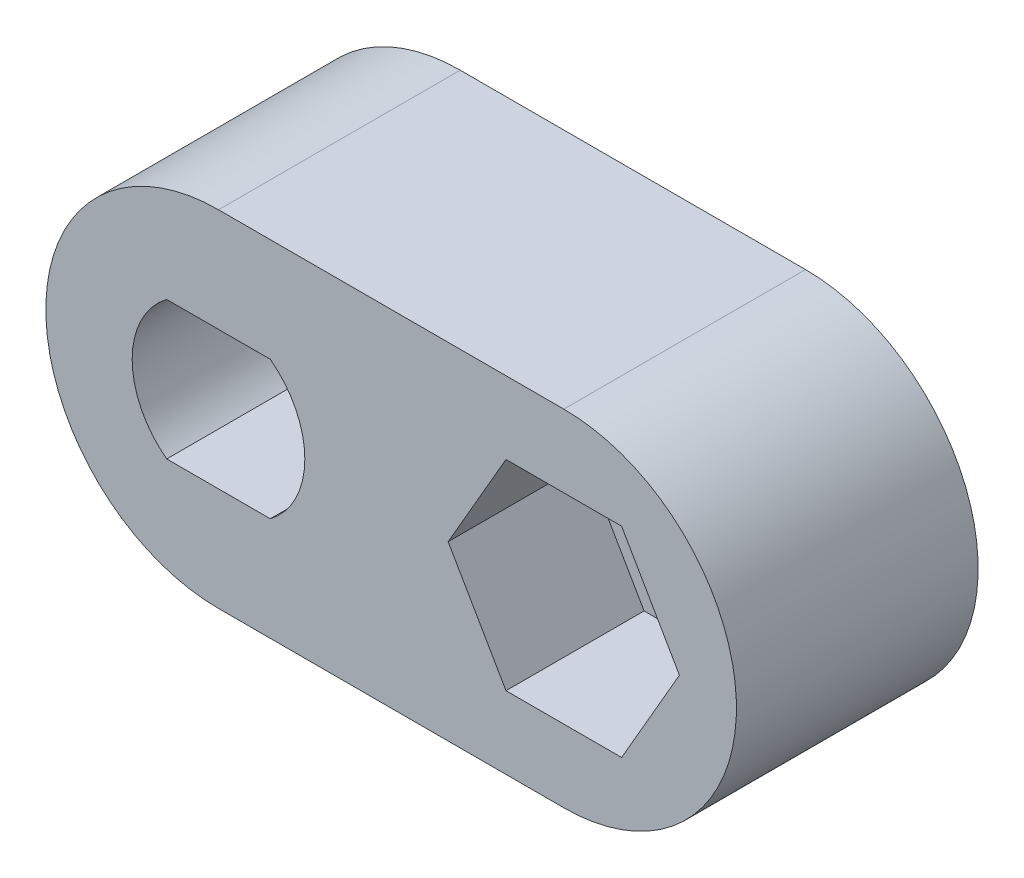
ISO-10303-21;
HEADER;
FILE_DESCRIPTION(('STEP AP214'),'2;1');
FILE_NAME('part.step','',(''),(''),'','','');
FILE_SCHEMA(('AUTOMOTIVE_DESIGN { 1 0 10303 214 1 1 1 1 }'));
ENDSEC;
DATA;
#1=APPLICATION_CONTEXT('core data for automotive mechanical design processes');
#2=APPLICATION_PROTOCOL_DEFINITION('international standard','automotive_design',2000,#1);
#3=PRODUCT_CONTEXT('',#1,'mechanical');
#4=PRODUCT('Part','Part','',(#3));
#5=PRODUCT_RELATED_PRODUCT_CATEGORY('part','',(#4));
#6=PRODUCT_DEFINITION_FORMATION('','',#4);
#7=PRODUCT_DEFINITION_CONTEXT('part definition',#1,'design');
#8=PRODUCT_DEFINITION('design','',#6,#7);
#9=PRODUCT_DEFINITION_SHAPE('','',#8);
#10=(LENGTH_UNIT() NAMED_UNIT(*) SI_UNIT(.MILLI.,.METRE.));
#11=(NAMED_UNIT(*) PLANE_ANGLE_UNIT() SI_UNIT($,.RADIAN.));
#12=(NAMED_UNIT(*) SI_UNIT($,.STERADIAN.) SOLID_ANGLE_UNIT());
#13=UNCERTAINTY_MEASURE_WITH_UNIT(LENGTH_MEASURE(1.E-05),#10,'distance_accuracy_value','');
#14=(GEOMETRIC_REPRESENTATION_CONTEXT(3) GLOBAL_UNCERTAINTY_ASSIGNED_CONTEXT((#13)) GLOBAL_UNIT_ASSIGNED_CONTEXT((#10,
#11,#12)) REPRESENTATION_CONTEXT('',''));
#15=CARTESIAN_POINT('',(0.,0.,0.));
#16=DIRECTION('',(0.,0.,1.));
#17=DIRECTION('',(1.,0.,0.));
#18=AXIS2_PLACEMENT_3D('',#15,#16,#17);
#19=CARTESIAN_POINT('',(10.,0.,0.));
#20=DIRECTION('',(0.,0.,-1.));
#21=DIRECTION('',(-1.,0.,0.));
#22=AXIS2_PLACEMENT_3D('',#19,#20,#21);
#23=CYLINDRICAL_SURFACE('',#22,2.07500000000001);
#24=CARTESIAN_POINT('',(10.,0.,0.));
#25=DIRECTION('',(0.,0.,-1.));
#26=DIRECTION('',(-1.,0.,0.));
#27=AXIS2_PLACEMENT_3D('',#24,#25,#26);
#28=CIRCLE('',#27,2.07500000000001);
#29=CARTESIAN_POINT('',(7.92499999999999,0.,0.));
#30=VERTEX_POINT('',#29);
#31=EDGE_CURVE('E207',#30,#30,#28,.T.);
#32=ORIENTED_EDGE('',*,*,#31,.T.);
#33=EDGE_LOOP('',(#32));
#34=FACE_BOUND('',#33,.T.);
#35=CARTESIAN_POINT('',(10.,0.,3.));
#36=DIRECTION('',(0.,0.,1.));
#37=DIRECTION('',(1.,0.,0.));
#38=AXIS2_PLACEMENT_3D('',#35,#36,#37);
#39=CIRCLE('',#38,2.07500000000001);
#40=CARTESIAN_POINT('',(12.075,0.,3.));
#41=VERTEX_POINT('',#40);
#42=EDGE_CURVE('E52',#41,#41,#39,.F.);
#43=ORIENTED_EDGE('',*,*,#42,.F.);
#44=EDGE_LOOP('',(#43));
#45=FACE_BOUND('',#44,.T.);
#46=ADVANCED_FACE('F48',(#34,#45),#23,.F.);
#47=CARTESIAN_POINT('',(0.,0.,7.));
#48=DIRECTION('',(0.,0.,-1.));
#49=DIRECTION('',(-1.,0.,0.));
#50=AXIS2_PLACEMENT_3D('',#47,#48,#49);
#51=CYLINDRICAL_SURFACE('',#50,5.);
#52=CARTESIAN_POINT('',(0.,0.,0.));
#53=DIRECTION('',(0.,0.,1.));
#54=DIRECTION('',(1.,0.,0.));
#55=AXIS2_PLACEMENT_3D('',#52,#53,#54);
#56=CIRCLE('',#55,5.);
#57=CARTESIAN_POINT('',(0.,5.,0.));
#58=VERTEX_POINT('',#57);
#59=CARTESIAN_POINT('',(0.,-5.,0.));
#60=VERTEX_POINT('',#59);
#61=EDGE_CURVE('E237',#58,#60,#56,.T.);
#62=ORIENTED_EDGE('',*,*,#61,.T.);
#63=DIRECTION('',(0.,0.,-1.));
#64=VECTOR('',#63,1.);
#65=CARTESIAN_POINT('',(0.,-5.,7.));
#66=LINE('',#65,#64);
#67=CARTESIAN_POINT('',(0.,-5.,7.));
#68=VERTEX_POINT('',#67);
#69=EDGE_CURVE('E13',#68,#60,#66,.T.);
#70=ORIENTED_EDGE('',*,*,#69,.F.);
#71=CARTESIAN_POINT('',(0.,0.,7.));
#72=DIRECTION('',(0.,0.,1.));
#73=DIRECTION('',(1.,0.,0.));
#74=AXIS2_PLACEMENT_3D('',#71,#72,#73);
#75=CIRCLE('',#74,5.);
#76=CARTESIAN_POINT('',(0.,5.,7.));
#77=VERTEX_POINT('',#76);
#78=EDGE_CURVE('E243',#77,#68,#75,.T.);
#79=ORIENTED_EDGE('',*,*,#78,.F.);
#80=DIRECTION('',(0.,0.,-1.));
#81=VECTOR('',#80,1.);
#82=CARTESIAN_POINT('',(0.,5.,7.));
#83=LINE('',#82,#81);
#84=EDGE_CURVE('E253',#77,#58,#83,.T.);
#85=ORIENTED_EDGE('',*,*,#84,.T.);
#86=EDGE_LOOP('',(#62,#70,#79,#85));
#87=FACE_BOUND('',#86,.T.);
#88=ADVANCED_FACE('F50',(#87),#51,.T.);
#89=CARTESIAN_POINT('',(0.,-5.,7.));
#90=DIRECTION('',(0.,1.,0.));
#91=DIRECTION('',(0.,0.,1.));
#92=AXIS2_PLACEMENT_3D('',#89,#90,#91);
#93=PLANE('',#92);
#94=DIRECTION('',(1.,0.,0.));
#95=VECTOR('',#94,1.);
#96=CARTESIAN_POINT('',(0.,-5.,0.));
#97=LINE('',#96,#95);
#98=CARTESIAN_POINT('',(10.,-5.,0.));
#99=VERTEX_POINT('',#98);
#100=EDGE_CURVE('E256',#60,#99,#97,.T.);
#101=ORIENTED_EDGE('',*,*,#100,.T.);
#102=DIRECTION('',(0.,0.,-1.));
#103=VECTOR('',#102,1.);
#104=CARTESIAN_POINT('',(10.,-5.,7.));
#105=LINE('',#104,#103);
#106=CARTESIAN_POINT('',(10.,-5.,7.));
#107=VERTEX_POINT('',#106);
#108=EDGE_CURVE('E57',#107,#99,#105,.T.);
#109=ORIENTED_EDGE('',*,*,#108,.F.);
#110=DIRECTION('',(1.,0.,0.));
#111=VECTOR('',#110,1.);
#112=CARTESIAN_POINT('',(0.,-5.,7.));
#113=LINE('',#112,#111);
#114=EDGE_CURVE('E246',#68,#107,#113,.T.);
#115=ORIENTED_EDGE('',*,*,#114,.F.);
#116=ORIENTED_EDGE('',*,*,#69,.T.);
#117=EDGE_LOOP('',(#101,#109,#115,#116));
#118=FACE_BOUND('',#117,.T.);
#119=ADVANCED_FACE('F312',(#118),#93,.F.);
#120=CARTESIAN_POINT('',(10.,0.,7.));
#121=DIRECTION('',(0.,0.,-1.));
#122=DIRECTION('',(-1.,0.,0.));
#123=AXIS2_PLACEMENT_3D('',#120,#121,#122);
#124=CYLINDRICAL_SURFACE('',#123,5.);
#125=CARTESIAN_POINT('',(10.,0.,0.));
#126=DIRECTION('',(0.,0.,1.));
#127=DIRECTION('',(1.,0.,0.));
#128=AXIS2_PLACEMENT_3D('',#125,#126,#127);
#129=CIRCLE('',#128,5.);
#130=CARTESIAN_POINT('',(10.,5.,0.));
#131=VERTEX_POINT('',#130);
#132=EDGE_CURVE('E258',#99,#131,#129,.T.);
#133=ORIENTED_EDGE('',*,*,#132,.T.);
#134=DIRECTION('',(0.,0.,-1.));
#135=VECTOR('',#134,1.);
#136=CARTESIAN_POINT('',(10.,5.,7.));
#137=LINE('',#136,#135);
#138=CARTESIAN_POINT('',(10.,5.,7.));
#139=VERTEX_POINT('',#138);
#140=EDGE_CURVE('E263',#139,#131,#137,.T.);
#141=ORIENTED_EDGE('',*,*,#140,.F.);
#142=CARTESIAN_POINT('',(10.,0.,7.));
#143=DIRECTION('',(0.,0.,1.));
#144=DIRECTION('',(1.,0.,0.));
#145=AXIS2_PLACEMENT_3D('',#142,#143,#144);
#146=CIRCLE('',#145,5.);
#147=EDGE_CURVE('E249',#107,#139,#146,.T.);
#148=ORIENTED_EDGE('',*,*,#147,.F.);
#149=ORIENTED_EDGE('',*,*,#108,.T.);
#150=EDGE_LOOP('',(#133,#141,#148,#149));
#151=FACE_BOUND('',#150,.T.);
#152=ADVANCED_FACE('F415',(#151),#124,.T.);
#153=CARTESIAN_POINT('',(0.,5.,7.));
#154=DIRECTION('',(0.,-1.,0.));
#155=DIRECTION('',(0.,0.,-1.));
#156=AXIS2_PLACEMENT_3D('',#153,#154,#155);
#157=PLANE('',#156);
#158=DIRECTION('',(-1.,0.,0.));
#159=VECTOR('',#158,1.);
#160=CARTESIAN_POINT('',(0.,5.,0.));
#161=LINE('',#160,#159);
#162=EDGE_CURVE('E247',#131,#58,#161,.T.);
#163=ORIENTED_EDGE('',*,*,#162,.T.);
#164=ORIENTED_EDGE('',*,*,#84,.F.);
#165=DIRECTION('',(-1.,0.,0.));
#166=VECTOR('',#165,1.);
#167=CARTESIAN_POINT('',(0.,5.,7.));
#168=LINE('',#167,#166);
#169=EDGE_CURVE('E251',#139,#77,#168,.T.);
#170=ORIENTED_EDGE('',*,*,#169,.F.);
#171=ORIENTED_EDGE('',*,*,#140,.T.);
#172=EDGE_LOOP('',(#163,#164,#170,#171));
#173=FACE_BOUND('',#172,.T.);
#174=ADVANCED_FACE('F407',(#173),#157,.F.);
#175=CARTESIAN_POINT('',(0.,0.,7.));
#176=DIRECTION('',(0.,0.,1.));
#177=DIRECTION('',(1.,0.,0.));
#178=AXIS2_PLACEMENT_3D('',#175,#176,#177);
#179=PLANE('',#178);
#180=DIRECTION('',(0.5,-0.866025403784439,0.));
#181=VECTOR('',#180,1.);
#182=CARTESIAN_POINT('',(6.65136843870017,0.,7.));
#183=LINE('',#182,#181);
#184=CARTESIAN_POINT('',(6.65136843870017,0.,7.));
#185=VERTEX_POINT('',#184);
#186=CARTESIAN_POINT('',(8.32568421935009,-2.9,7.));
#187=VERTEX_POINT('',#186);
#188=EDGE_CURVE('E65',#185,#187,#183,.T.);
#189=ORIENTED_EDGE('',*,*,#188,.F.);
#190=DIRECTION('',(-0.5,-0.866025403784438,0.));
#191=VECTOR('',#190,1.);
#192=CARTESIAN_POINT('',(8.32568421935009,2.9,7.));
#193=LINE('',#192,#191);
#194=CARTESIAN_POINT('',(8.32568421935009,2.9,7.));
#195=VERTEX_POINT('',#194);
#196=EDGE_CURVE('E174',#195,#185,#193,.T.);
#197=ORIENTED_EDGE('',*,*,#196,.F.);
#198=DIRECTION('',(-1.,0.,0.));
#199=VECTOR('',#198,1.);
#200=CARTESIAN_POINT('',(11.6743157806499,2.9,7.));
#201=LINE('',#200,#199);
#202=CARTESIAN_POINT('',(11.6743157806499,2.9,7.));
#203=VERTEX_POINT('',#202);
#204=EDGE_CURVE('E177',#203,#195,#201,.T.);
#205=ORIENTED_EDGE('',*,*,#204,.F.);
#206=DIRECTION('',(-0.5,0.866025403784439,0.));
#207=VECTOR('',#206,1.);
#208=CARTESIAN_POINT('',(13.3486315612998,0.,7.));
#209=LINE('',#208,#207);
#210=CARTESIAN_POINT('',(13.3486315612998,0.,7.));
#211=VERTEX_POINT('',#210);
#212=EDGE_CURVE('E193',#211,#203,#209,.T.);
#213=ORIENTED_EDGE('',*,*,#212,.F.);
#214=DIRECTION('',(0.5,0.866025403784438,0.));
#215=VECTOR('',#214,1.);
#216=CARTESIAN_POINT('',(11.6743157806499,-2.9,7.));
#217=LINE('',#216,#215);
#218=CARTESIAN_POINT('',(11.6743157806499,-2.9,7.));
#219=VERTEX_POINT('',#218);
#220=EDGE_CURVE('E190',#219,#211,#217,.T.);
#221=ORIENTED_EDGE('',*,*,#220,.F.);
#222=DIRECTION('',(1.,0.,0.));
#223=VECTOR('',#222,1.);
#224=CARTESIAN_POINT('',(8.32568421935009,-2.9,7.));
#225=LINE('',#224,#223);
#226=EDGE_CURVE('E188',#187,#219,#225,.T.);
#227=ORIENTED_EDGE('',*,*,#226,.F.);
#228=EDGE_LOOP('',(#189,#197,#205,#213,#221,#227));
#229=FACE_BOUND('',#228,.T.);
#230=CARTESIAN_POINT('',(0.,0.,7.));
#231=DIRECTION('',(0.,0.,1.));
#232=DIRECTION('',(1.,0.,0.));
#233=AXIS2_PLACEMENT_3D('',#230,#231,#232);
#234=CIRCLE('',#233,2.5);
#235=CARTESIAN_POINT('',(1.5,-2.,7.));
#236=VERTEX_POINT('',#235);
#237=CARTESIAN_POINT('',(1.5,2.,7.));
#238=VERTEX_POINT('',#237);
#239=EDGE_CURVE('E73',#236,#238,#234,.T.);
#240=ORIENTED_EDGE('',*,*,#239,.F.);
#241=DIRECTION('',(1.,0.,0.));
#242=VECTOR('',#241,1.);
#243=CARTESIAN_POINT('',(0.,-2.,7.));
#244=LINE('',#243,#242);
#245=CARTESIAN_POINT('',(-1.5,-2.,7.));
#246=VERTEX_POINT('',#245);
#247=EDGE_CURVE('E221',#246,#236,#244,.T.);
#248=ORIENTED_EDGE('',*,*,#247,.F.);
#249=CARTESIAN_POINT('',(-1.5,2.,7.));
#250=VERTEX_POINT('',#249);
#251=EDGE_CURVE('E230',#250,#246,#234,.T.);
#252=ORIENTED_EDGE('',*,*,#251,.F.);
#253=DIRECTION('',(1.,0.,0.));
#254=VECTOR('',#253,1.);
#255=CARTESIAN_POINT('',(0.,2.,7.));
#256=LINE('',#255,#254);
#257=EDGE_CURVE('E229',#250,#238,#256,.T.);
#258=ORIENTED_EDGE('',*,*,#257,.T.);
#259=EDGE_LOOP('',(#240,#248,#252,#258));
#260=FACE_BOUND('',#259,.T.);
#261=ORIENTED_EDGE('',*,*,#78,.T.);
#262=ORIENTED_EDGE('',*,*,#114,.T.);
#263=ORIENTED_EDGE('',*,*,#147,.T.);
#264=ORIENTED_EDGE('',*,*,#169,.T.);
#265=EDGE_LOOP('',(#261,#262,#263,#264));
#266=FACE_BOUND('',#265,.T.);
#267=ADVANCED_FACE('F288',(#229,#260,#266),#179,.T.);
#268=CARTESIAN_POINT('',(0.,0.,0.));
#269=DIRECTION('',(0.,0.,1.));
#270=DIRECTION('',(1.,0.,0.));
#271=AXIS2_PLACEMENT_3D('',#268,#269,#270);
#272=PLANE('',#271);
#273=ORIENTED_EDGE('',*,*,#31,.F.);
#274=EDGE_LOOP('',(#273));
#275=FACE_BOUND('',#274,.T.);
#276=CARTESIAN_POINT('',(0.,0.,0.));
#277=DIRECTION('',(0.,0.,-1.));
#278=DIRECTION('',(-1.,0.,0.));
#279=AXIS2_PLACEMENT_3D('',#276,#277,#278);
#280=CIRCLE('',#279,3.36);
#281=CARTESIAN_POINT('',(-3.36,0.,0.));
#282=VERTEX_POINT('',#281);
#283=EDGE_CURVE('E210',#282,#282,#280,.T.);
#284=ORIENTED_EDGE('',*,*,#283,.F.);
#285=EDGE_LOOP('',(#284));
#286=FACE_BOUND('',#285,.T.);
#287=ORIENTED_EDGE('',*,*,#61,.F.);
#288=ORIENTED_EDGE('',*,*,#162,.F.);
#289=ORIENTED_EDGE('',*,*,#132,.F.);
#290=ORIENTED_EDGE('',*,*,#100,.F.);
#291=EDGE_LOOP('',(#287,#288,#289,#290));
#292=FACE_BOUND('',#291,.T.);
#293=ADVANCED_FACE('F303',(#275,#286,#292),#272,.F.);
#294=CARTESIAN_POINT('',(0.,0.,3.));
#295=DIRECTION('',(0.,0.,1.));
#296=DIRECTION('',(1.,0.,0.));
#297=AXIS2_PLACEMENT_3D('',#294,#295,#296);
#298=CYLINDRICAL_SURFACE('',#297,2.5);
#299=ORIENTED_EDGE('',*,*,#239,.T.);
#300=DIRECTION('',(0.,0.,1.));
#301=VECTOR('',#300,1.);
#302=CARTESIAN_POINT('',(1.5,2.,3.));
#303=LINE('',#302,#301);
#304=CARTESIAN_POINT('',(1.5,2.,3.));
#305=VERTEX_POINT('',#304);
#306=EDGE_CURVE('E227',#305,#238,#303,.T.);
#307=ORIENTED_EDGE('',*,*,#306,.F.);
#308=CARTESIAN_POINT('',(0.,0.,3.));
#309=DIRECTION('',(0.,0.,1.));
#310=DIRECTION('',(1.,0.,0.));
#311=AXIS2_PLACEMENT_3D('',#308,#309,#310);
#312=CIRCLE('',#311,2.5);
#313=CARTESIAN_POINT('',(1.5,-2.,3.));
#314=VERTEX_POINT('',#313);
#315=EDGE_CURVE('E217',#314,#305,#312,.T.);
#316=ORIENTED_EDGE('',*,*,#315,.F.);
#317=DIRECTION('',(0.,0.,1.));
#318=VECTOR('',#317,1.);
#319=CARTESIAN_POINT('',(1.5,-2.,3.));
#320=LINE('',#319,#318);
#321=EDGE_CURVE('E235',#314,#236,#320,.T.);
#322=ORIENTED_EDGE('',*,*,#321,.T.);
#323=EDGE_LOOP('',(#299,#307,#316,#322));
#324=FACE_BOUND('',#323,.T.);
#325=ADVANCED_FACE('F283',(#324),#298,.F.);
#326=CARTESIAN_POINT('',(0.,-2.,3.));
#327=DIRECTION('',(0.,-1.,0.));
#328=DIRECTION('',(0.,0.,-1.));
#329=AXIS2_PLACEMENT_3D('',#326,#327,#328);
#330=PLANE('',#329);
#331=ORIENTED_EDGE('',*,*,#247,.T.);
#332=ORIENTED_EDGE('',*,*,#321,.F.);
#333=DIRECTION('',(1.,0.,0.));
#334=VECTOR('',#333,1.);
#335=CARTESIAN_POINT('',(0.,-2.,3.));
#336=LINE('',#335,#334);
#337=CARTESIAN_POINT('',(-1.5,-2.,3.));
#338=VERTEX_POINT('',#337);
#339=EDGE_CURVE('E224',#338,#314,#336,.T.);
#340=ORIENTED_EDGE('',*,*,#339,.F.);
#341=DIRECTION('',(0.,0.,1.));
#342=VECTOR('',#341,1.);
#343=CARTESIAN_POINT('',(-1.5,-2.,3.));
#344=LINE('',#343,#342);
#345=EDGE_CURVE('E238',#338,#246,#344,.T.);
#346=ORIENTED_EDGE('',*,*,#345,.T.);
#347=EDGE_LOOP('',(#331,#332,#340,#346));
#348=FACE_BOUND('',#347,.T.);
#349=ADVANCED_FACE('F295',(#348),#330,.F.);
#350=ORIENTED_EDGE('',*,*,#251,.T.);
#351=ORIENTED_EDGE('',*,*,#345,.F.);
#352=CARTESIAN_POINT('',(-1.5,2.,3.));
#353=VERTEX_POINT('',#352);
#354=EDGE_CURVE('E222',#353,#338,#312,.T.);
#355=ORIENTED_EDGE('',*,*,#354,.F.);
#356=DIRECTION('',(0.,0.,1.));
#357=VECTOR('',#356,1.);
#358=CARTESIAN_POINT('',(-1.5,2.,3.));
#359=LINE('',#358,#357);
#360=EDGE_CURVE('E240',#353,#250,#359,.T.);
#361=ORIENTED_EDGE('',*,*,#360,.T.);
#362=EDGE_LOOP('',(#350,#351,#355,#361));
#363=FACE_BOUND('',#362,.T.);
#364=ADVANCED_FACE('F293',(#363),#298,.F.);
#365=CARTESIAN_POINT('',(0.,2.,3.));
#366=DIRECTION('',(0.,-1.,0.));
#367=DIRECTION('',(0.,0.,-1.));
#368=AXIS2_PLACEMENT_3D('',#365,#366,#367);
#369=PLANE('',#368);
#370=ORIENTED_EDGE('',*,*,#257,.F.);
#371=ORIENTED_EDGE('',*,*,#360,.F.);
#372=DIRECTION('',(1.,0.,0.));
#373=VECTOR('',#372,1.);
#374=CARTESIAN_POINT('',(0.,2.,3.));
#375=LINE('',#374,#373);
#376=EDGE_CURVE('E220',#353,#305,#375,.T.);
#377=ORIENTED_EDGE('',*,*,#376,.T.);
#378=ORIENTED_EDGE('',*,*,#306,.T.);
#379=EDGE_LOOP('',(#370,#371,#377,#378));
#380=FACE_BOUND('',#379,.T.);
#381=ADVANCED_FACE('F276',(#380),#369,.T.);
#382=CARTESIAN_POINT('',(0.,0.,3.));
#383=DIRECTION('',(0.,0.,1.));
#384=DIRECTION('',(1.,0.,0.));
#385=AXIS2_PLACEMENT_3D('',#382,#383,#384);
#386=PLANE('',#385);
#387=CARTESIAN_POINT('',(0.,0.,3.));
#388=DIRECTION('',(0.,0.,1.));
#389=DIRECTION('',(1.,0.,0.));
#390=AXIS2_PLACEMENT_3D('',#387,#388,#389);
#391=CIRCLE('',#390,1.7);
#392=CARTESIAN_POINT('',(1.7,0.,3.));
#393=VERTEX_POINT('',#392);
#394=EDGE_CURVE('E216',#393,#393,#391,.T.);
#395=ORIENTED_EDGE('',*,*,#394,.F.);
#396=EDGE_LOOP('',(#395));
#397=FACE_BOUND('',#396,.T.);
#398=ORIENTED_EDGE('',*,*,#315,.T.);
#399=ORIENTED_EDGE('',*,*,#376,.F.);
#400=ORIENTED_EDGE('',*,*,#354,.T.);
#401=ORIENTED_EDGE('',*,*,#339,.T.);
#402=EDGE_LOOP('',(#398,#399,#400,#401));
#403=FACE_BOUND('',#402,.T.);
#404=ADVANCED_FACE('F273',(#397,#403),#386,.T.);
#405=CARTESIAN_POINT('',(0.,0.,0.));
#406=DIRECTION('',(0.,0.,-1.));
#407=DIRECTION('',(-1.,0.,0.));
#408=AXIS2_PLACEMENT_3D('',#405,#406,#407);
#409=CYLINDRICAL_SURFACE('',#408,1.7);
#410=ORIENTED_EDGE('',*,*,#394,.T.);
#411=EDGE_LOOP('',(#410));
#412=FACE_BOUND('',#411,.T.);
#413=CARTESIAN_POINT('',(0.,0.,1.66));
#414=DIRECTION('',(0.,0.,-1.));
#415=DIRECTION('',(-1.,0.,0.));
#416=AXIS2_PLACEMENT_3D('',#413,#414,#415);
#417=CIRCLE('',#416,1.7);
#418=CARTESIAN_POINT('',(-1.7,0.,1.66));
#419=VERTEX_POINT('',#418);
#420=EDGE_CURVE('E213',#419,#419,#417,.T.);
#421=ORIENTED_EDGE('',*,*,#420,.T.);
#422=EDGE_LOOP('',(#421));
#423=FACE_BOUND('',#422,.T.);
#424=ADVANCED_FACE('F270',(#412,#423),#409,.F.);
#425=CARTESIAN_POINT('',(0.,0.,0.));
#426=DIRECTION('',(0.,0.,-1.));
#427=DIRECTION('',(-1.,0.,0.));
#428=AXIS2_PLACEMENT_3D('',#425,#426,#427);
#429=CONICAL_SURFACE('',#428,3.36,0.785398163397448);
#430=ORIENTED_EDGE('',*,*,#420,.F.);
#431=EDGE_LOOP('',(#430));
#432=FACE_BOUND('',#431,.T.);
#433=ORIENTED_EDGE('',*,*,#283,.T.);
#434=EDGE_LOOP('',(#433));
#435=FACE_BOUND('',#434,.T.);
#436=ADVANCED_FACE('F318',(#432,#435),#429,.F.);
#437=CARTESIAN_POINT('',(0.,0.,3.));
#438=DIRECTION('',(0.,0.,1.));
#439=DIRECTION('',(1.,0.,0.));
#440=AXIS2_PLACEMENT_3D('',#437,#438,#439);
#441=PLANE('',#440);
#442=DIRECTION('',(0.5,-0.866025403784439,0.));
#443=VECTOR('',#442,1.);
#444=CARTESIAN_POINT('',(6.65136843870017,0.,3.));
#445=LINE('',#444,#443);
#446=CARTESIAN_POINT('',(6.65136843870017,0.,3.));
#447=VERTEX_POINT('',#446);
#448=CARTESIAN_POINT('',(8.32568421935009,-2.9,3.));
#449=VERTEX_POINT('',#448);
#450=EDGE_CURVE('E154',#447,#449,#445,.T.);
#451=ORIENTED_EDGE('',*,*,#450,.T.);
#452=DIRECTION('',(1.,0.,0.));
#453=VECTOR('',#452,1.);
#454=CARTESIAN_POINT('',(8.32568421935009,-2.9,3.));
#455=LINE('',#454,#453);
#456=CARTESIAN_POINT('',(11.6743157806499,-2.9,3.));
#457=VERTEX_POINT('',#456);
#458=EDGE_CURVE('E163',#449,#457,#455,.T.);
#459=ORIENTED_EDGE('',*,*,#458,.T.);
#460=DIRECTION('',(0.5,0.866025403784438,0.));
#461=VECTOR('',#460,1.);
#462=CARTESIAN_POINT('',(11.6743157806499,-2.9,3.));
#463=LINE('',#462,#461);
#464=CARTESIAN_POINT('',(13.3486315612998,0.,3.));
#465=VERTEX_POINT('',#464);
#466=EDGE_CURVE('E168',#457,#465,#463,.T.);
#467=ORIENTED_EDGE('',*,*,#466,.T.);
#468=DIRECTION('',(-0.5,0.866025403784439,0.));
#469=VECTOR('',#468,1.);
#470=CARTESIAN_POINT('',(13.3486315612998,0.,3.));
#471=LINE('',#470,#469);
#472=CARTESIAN_POINT('',(11.6743157806499,2.9,3.));
#473=VERTEX_POINT('',#472);
#474=EDGE_CURVE('E181',#465,#473,#471,.T.);
#475=ORIENTED_EDGE('',*,*,#474,.T.);
#476=DIRECTION('',(-1.,0.,0.));
#477=VECTOR('',#476,1.);
#478=CARTESIAN_POINT('',(11.6743157806499,2.9,3.));
#479=LINE('',#478,#477);
#480=CARTESIAN_POINT('',(8.32568421935009,2.9,3.));
#481=VERTEX_POINT('',#480);
#482=EDGE_CURVE('E184',#473,#481,#479,.T.);
#483=ORIENTED_EDGE('',*,*,#482,.T.);
#484=DIRECTION('',(-0.5,-0.866025403784438,0.));
#485=VECTOR('',#484,1.);
#486=CARTESIAN_POINT('',(8.32568421935009,2.9,3.));
#487=LINE('',#486,#485);
#488=EDGE_CURVE('E160',#481,#447,#487,.T.);
#489=ORIENTED_EDGE('',*,*,#488,.T.);
#490=EDGE_LOOP('',(#451,#459,#467,#475,#483,#489));
#491=FACE_BOUND('',#490,.T.);
#492=ORIENTED_EDGE('',*,*,#42,.T.);
#493=EDGE_LOOP('',(#492));
#494=FACE_BOUND('',#493,.T.);
#495=ADVANCED_FACE('F170',(#491,#494),#441,.T.);
#496=CARTESIAN_POINT('',(6.65136843870017,0.,3.));
#497=DIRECTION('',(-0.866025403784439,-0.5,0.));
#498=DIRECTION('',(0.5,-0.866025403784439,0.));
#499=AXIS2_PLACEMENT_3D('',#496,#497,#498);
#500=PLANE('',#499);
#501=ORIENTED_EDGE('',*,*,#188,.T.);
#502=DIRECTION('',(0.,0.,1.));
#503=VECTOR('',#502,1.);
#504=CARTESIAN_POINT('',(8.32568421935009,-2.9,3.));
#505=LINE('',#504,#503);
#506=EDGE_CURVE('E150',#449,#187,#505,.T.);
#507=ORIENTED_EDGE('',*,*,#506,.F.);
#508=ORIENTED_EDGE('',*,*,#450,.F.);
#509=DIRECTION('',(0.,0.,1.));
#510=VECTOR('',#509,1.);
#511=CARTESIAN_POINT('',(6.65136843870017,0.,3.));
#512=LINE('',#511,#510);
#513=EDGE_CURVE('E198',#447,#185,#512,.T.);
#514=ORIENTED_EDGE('',*,*,#513,.T.);
#515=EDGE_LOOP('',(#501,#507,#508,#514));
#516=FACE_BOUND('',#515,.T.);
#517=ADVANCED_FACE('F152',(#516),#500,.F.);
#518=CARTESIAN_POINT('',(8.32568421935009,2.9,3.));
#519=DIRECTION('',(-0.866025403784439,0.5,0.));
#520=DIRECTION('',(-0.5,-0.866025403784439,0.));
#521=AXIS2_PLACEMENT_3D('',#518,#519,#520);
#522=PLANE('',#521);
#523=ORIENTED_EDGE('',*,*,#196,.T.);
#524=ORIENTED_EDGE('',*,*,#513,.F.);
#525=ORIENTED_EDGE('',*,*,#488,.F.);
#526=DIRECTION('',(0.,0.,1.));
#527=VECTOR('',#526,1.);
#528=CARTESIAN_POINT('',(8.32568421935009,2.9,3.));
#529=LINE('',#528,#527);
#530=EDGE_CURVE('E200',#481,#195,#529,.T.);
#531=ORIENTED_EDGE('',*,*,#530,.T.);
#532=EDGE_LOOP('',(#523,#524,#525,#531));
#533=FACE_BOUND('',#532,.T.);
#534=ADVANCED_FACE('F348',(#533),#522,.F.);
#535=CARTESIAN_POINT('',(11.6743157806499,2.9,3.));
#536=DIRECTION('',(0.,1.,0.));
#537=DIRECTION('',(0.,0.,1.));
#538=AXIS2_PLACEMENT_3D('',#535,#536,#537);
#539=PLANE('',#538);
#540=ORIENTED_EDGE('',*,*,#204,.T.);
#541=ORIENTED_EDGE('',*,*,#530,.F.);
#542=ORIENTED_EDGE('',*,*,#482,.F.);
#543=DIRECTION('',(0.,0.,1.));
#544=VECTOR('',#543,1.);
#545=CARTESIAN_POINT('',(11.6743157806499,2.9,3.));
#546=LINE('',#545,#544);
#547=EDGE_CURVE('E202',#473,#203,#546,.T.);
#548=ORIENTED_EDGE('',*,*,#547,.T.);
#549=EDGE_LOOP('',(#540,#541,#542,#548));
#550=FACE_BOUND('',#549,.T.);
#551=ADVANCED_FACE('F354',(#550),#539,.F.);
#552=CARTESIAN_POINT('',(13.3486315612998,0.,3.));
#553=DIRECTION('',(0.866025403784439,0.5,0.));
#554=DIRECTION('',(-0.5,0.866025403784439,0.));
#555=AXIS2_PLACEMENT_3D('',#552,#553,#554);
#556=PLANE('',#555);
#557=ORIENTED_EDGE('',*,*,#212,.T.);
#558=ORIENTED_EDGE('',*,*,#547,.F.);
#559=ORIENTED_EDGE('',*,*,#474,.F.);
#560=DIRECTION('',(0.,0.,1.));
#561=VECTOR('',#560,1.);
#562=CARTESIAN_POINT('',(13.3486315612998,0.,3.));
#563=LINE('',#562,#561);
#564=EDGE_CURVE('E204',#465,#211,#563,.T.);
#565=ORIENTED_EDGE('',*,*,#564,.T.);
#566=EDGE_LOOP('',(#557,#558,#559,#565));
#567=FACE_BOUND('',#566,.T.);
#568=ADVANCED_FACE('F362',(#567),#556,.F.);
#569=CARTESIAN_POINT('',(11.6743157806499,-2.9,3.));
#570=DIRECTION('',(0.866025403784438,-0.5,0.));
#571=DIRECTION('',(0.5,0.866025403784438,0.));
#572=AXIS2_PLACEMENT_3D('',#569,#570,#571);
#573=PLANE('',#572);
#574=ORIENTED_EDGE('',*,*,#220,.T.);
#575=ORIENTED_EDGE('',*,*,#564,.F.);
#576=ORIENTED_EDGE('',*,*,#466,.F.);
#577=DIRECTION('',(0.,0.,1.));
#578=VECTOR('',#577,1.);
#579=CARTESIAN_POINT('',(11.6743157806499,-2.9,3.));
#580=LINE('',#579,#578);
#581=EDGE_CURVE('E159',#457,#219,#580,.T.);
#582=ORIENTED_EDGE('',*,*,#581,.T.);
#583=EDGE_LOOP('',(#574,#575,#576,#582));
#584=FACE_BOUND('',#583,.T.);
#585=ADVANCED_FACE('F370',(#584),#573,.F.);
#586=CARTESIAN_POINT('',(8.32568421935009,-2.9,3.));
#587=DIRECTION('',(0.,-1.,0.));
#588=DIRECTION('',(0.,0.,-1.));
#589=AXIS2_PLACEMENT_3D('',#586,#587,#588);
#590=PLANE('',#589);
#591=ORIENTED_EDGE('',*,*,#226,.T.);
#592=ORIENTED_EDGE('',*,*,#581,.F.);
#593=ORIENTED_EDGE('',*,*,#458,.F.);
#594=ORIENTED_EDGE('',*,*,#506,.T.);
#595=EDGE_LOOP('',(#591,#592,#593,#594));
#596=FACE_BOUND('',#595,.T.);
#597=ADVANCED_FACE('F164',(#596),#590,.F.);
#598=CLOSED_SHELL('',(#46,#88,#119,#152,#174,#267,#293,#325,#349,#364,#381,#404,#424,#436,#495,
#517,#534,#551,#568,#585,#597));
#599=MANIFOLD_SOLID_BREP('B2',#598);
#600=ADVANCED_BREP_SHAPE_REPRESENTATION('',(#18,#599),#14);
#601=SHAPE_DEFINITION_REPRESENTATION(#9,#600);
ENDSEC;
END-ISO-10303-21;
